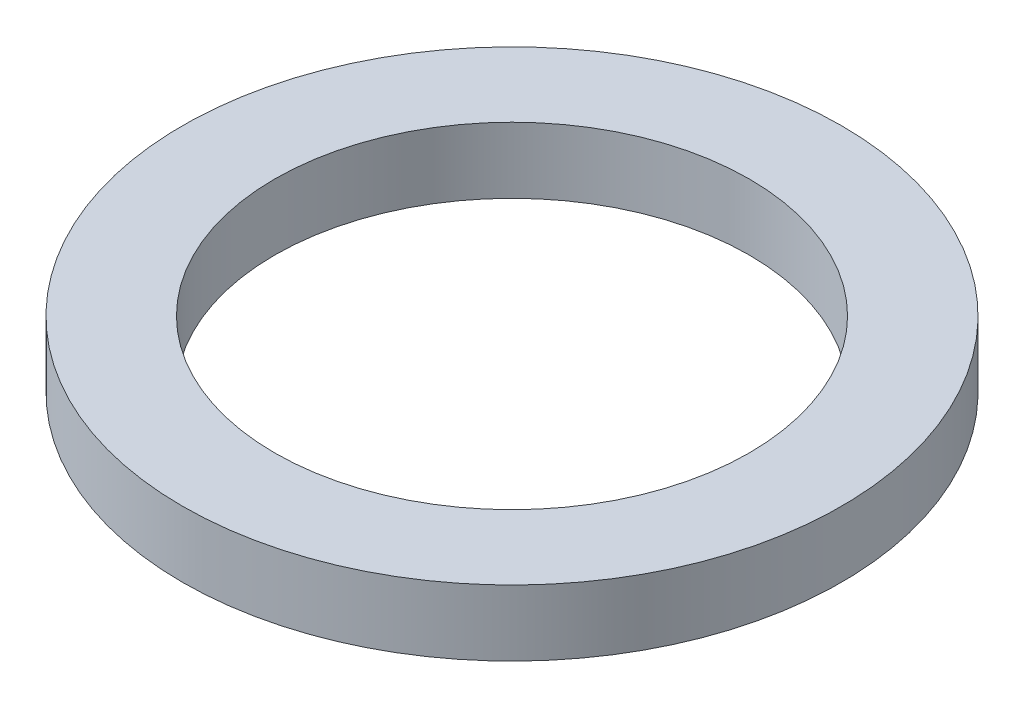
ISO-10303-21;
HEADER;
FILE_DESCRIPTION(('STEP AP214'),'2;1');
FILE_NAME('part.step','',(''),(''),'','','');
FILE_SCHEMA(('AUTOMOTIVE_DESIGN { 1 0 10303 214 1 1 1 1 }'));
ENDSEC;
DATA;
#1=APPLICATION_CONTEXT('core data for automotive mechanical design processes');
#2=APPLICATION_PROTOCOL_DEFINITION('international standard','automotive_design',2000,#1);
#3=PRODUCT_CONTEXT('',#1,'mechanical');
#4=PRODUCT('Part','Part','',(#3));
#5=PRODUCT_RELATED_PRODUCT_CATEGORY('part','',(#4));
#6=PRODUCT_DEFINITION_FORMATION('','',#4);
#7=PRODUCT_DEFINITION_CONTEXT('part definition',#1,'design');
#8=PRODUCT_DEFINITION('design','',#6,#7);
#9=PRODUCT_DEFINITION_SHAPE('','',#8);
#10=(LENGTH_UNIT() NAMED_UNIT(*) SI_UNIT(.MILLI.,.METRE.));
#11=(NAMED_UNIT(*) PLANE_ANGLE_UNIT() SI_UNIT($,.RADIAN.));
#12=(NAMED_UNIT(*) SI_UNIT($,.STERADIAN.) SOLID_ANGLE_UNIT());
#13=UNCERTAINTY_MEASURE_WITH_UNIT(LENGTH_MEASURE(1.E-05),#10,'distance_accuracy_value','');
#14=(GEOMETRIC_REPRESENTATION_CONTEXT(3) GLOBAL_UNCERTAINTY_ASSIGNED_CONTEXT((#13)) GLOBAL_UNIT_ASSIGNED_CONTEXT((#10,
#11,#12)) REPRESENTATION_CONTEXT('',''));
#15=CARTESIAN_POINT('',(0.,0.,0.));
#16=DIRECTION('',(0.,0.,1.));
#17=DIRECTION('',(1.,0.,0.));
#18=AXIS2_PLACEMENT_3D('',#15,#16,#17);
#19=CARTESIAN_POINT('',(0.,10.,0.));
#20=DIRECTION('',(0.,1.,0.));
#21=DIRECTION('',(0.,0.,1.));
#22=AXIS2_PLACEMENT_3D('',#19,#20,#21);
#23=PLANE('',#22);
#24=CARTESIAN_POINT('',(0.,10.,0.));
#25=DIRECTION('',(0.,1.,0.));
#26=DIRECTION('',(0.,0.,1.));
#27=AXIS2_PLACEMENT_3D('',#24,#25,#26);
#28=CIRCLE('',#27,36.);
#29=CARTESIAN_POINT('',(0.,10.,36.));
#30=VERTEX_POINT('',#29);
#31=EDGE_CURVE('E27',#30,#30,#28,.F.);
#32=ORIENTED_EDGE('',*,*,#31,.T.);
#33=EDGE_LOOP('',(#32));
#34=FACE_BOUND('',#33,.T.);
#35=CARTESIAN_POINT('',(0.,10.,0.));
#36=DIRECTION('',(0.,1.,0.));
#37=DIRECTION('',(0.,0.,1.));
#38=AXIS2_PLACEMENT_3D('',#35,#36,#37);
#39=CIRCLE('',#38,50.);
#40=CARTESIAN_POINT('',(0.,10.,50.));
#41=VERTEX_POINT('',#40);
#42=EDGE_CURVE('E18',#41,#41,#39,.F.);
#43=ORIENTED_EDGE('',*,*,#42,.F.);
#44=EDGE_LOOP('',(#43));
#45=FACE_BOUND('',#44,.T.);
#46=ADVANCED_FACE('F15',(#34,#45),#23,.T.);
#47=CARTESIAN_POINT('',(0.,0.,0.));
#48=DIRECTION('',(0.,1.,0.));
#49=DIRECTION('',(0.,0.,1.));
#50=AXIS2_PLACEMENT_3D('',#47,#48,#49);
#51=CYLINDRICAL_SURFACE('',#50,50.);
#52=ORIENTED_EDGE('',*,*,#42,.T.);
#53=EDGE_LOOP('',(#52));
#54=FACE_BOUND('',#53,.T.);
#55=CARTESIAN_POINT('',(0.,0.,0.));
#56=DIRECTION('',(0.,1.,0.));
#57=DIRECTION('',(0.,0.,1.));
#58=AXIS2_PLACEMENT_3D('',#55,#56,#57);
#59=CIRCLE('',#58,50.);
#60=CARTESIAN_POINT('',(0.,0.,50.));
#61=VERTEX_POINT('',#60);
#62=EDGE_CURVE('E22',#61,#61,#59,.T.);
#63=ORIENTED_EDGE('',*,*,#62,.T.);
#64=EDGE_LOOP('',(#63));
#65=FACE_BOUND('',#64,.T.);
#66=ADVANCED_FACE('F35',(#54,#65),#51,.T.);
#67=CARTESIAN_POINT('',(0.,0.,0.));
#68=DIRECTION('',(0.,1.,0.));
#69=DIRECTION('',(0.,0.,1.));
#70=AXIS2_PLACEMENT_3D('',#67,#68,#69);
#71=CYLINDRICAL_SURFACE('',#70,36.);
#72=ORIENTED_EDGE('',*,*,#31,.F.);
#73=EDGE_LOOP('',(#72));
#74=FACE_BOUND('',#73,.T.);
#75=CARTESIAN_POINT('',(0.,0.,0.));
#76=DIRECTION('',(0.,1.,0.));
#77=DIRECTION('',(0.,0.,1.));
#78=AXIS2_PLACEMENT_3D('',#75,#76,#77);
#79=CIRCLE('',#78,36.);
#80=CARTESIAN_POINT('',(0.,0.,36.));
#81=VERTEX_POINT('',#80);
#82=EDGE_CURVE('E10',#81,#81,#79,.F.);
#83=ORIENTED_EDGE('',*,*,#82,.T.);
#84=EDGE_LOOP('',(#83));
#85=FACE_BOUND('',#84,.T.);
#86=ADVANCED_FACE('F43',(#74,#85),#71,.F.);
#87=CARTESIAN_POINT('',(0.,0.,0.));
#88=DIRECTION('',(0.,1.,0.));
#89=DIRECTION('',(0.,0.,1.));
#90=AXIS2_PLACEMENT_3D('',#87,#88,#89);
#91=PLANE('',#90);
#92=ORIENTED_EDGE('',*,*,#82,.F.);
#93=EDGE_LOOP('',(#92));
#94=FACE_BOUND('',#93,.T.);
#95=ORIENTED_EDGE('',*,*,#62,.F.);
#96=EDGE_LOOP('',(#95));
#97=FACE_BOUND('',#96,.T.);
#98=ADVANCED_FACE('F44',(#94,#97),#91,.F.);
#99=CLOSED_SHELL('',(#46,#66,#86,#98));
#100=MANIFOLD_SOLID_BREP('B1',#99);
#101=ADVANCED_BREP_SHAPE_REPRESENTATION('',(#18,#100),#14);
#102=SHAPE_DEFINITION_REPRESENTATION(#9,#101);
ENDSEC;
END-ISO-10303-21;
